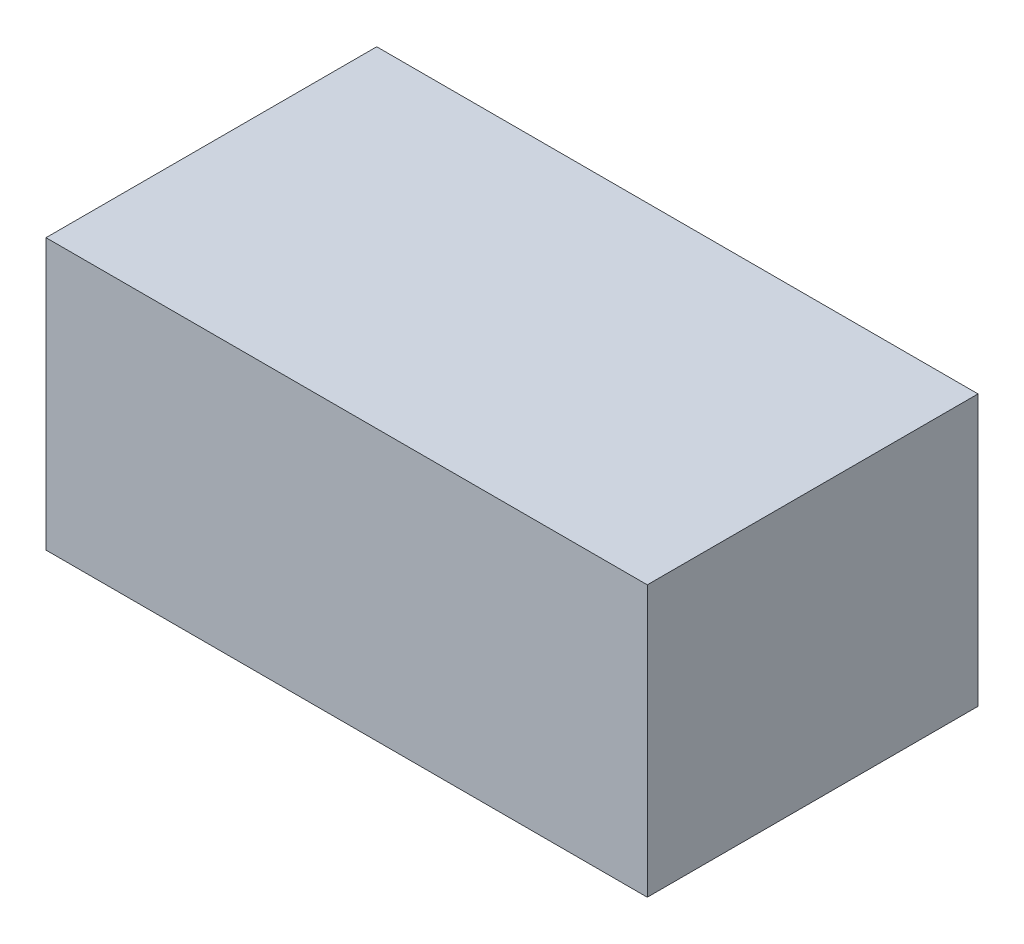
ISO-10303-21;
HEADER;
FILE_DESCRIPTION(('STEP AP214'),'2;1');
FILE_NAME('part.step','',(''),(''),'','','');
FILE_SCHEMA(('AUTOMOTIVE_DESIGN { 1 0 10303 214 1 1 1 1 }'));
ENDSEC;
DATA;
#1=APPLICATION_CONTEXT('core data for automotive mechanical design processes');
#2=APPLICATION_PROTOCOL_DEFINITION('international standard','automotive_design',2000,#1);
#3=PRODUCT_CONTEXT('',#1,'mechanical');
#4=PRODUCT('Part','Part','',(#3));
#5=PRODUCT_RELATED_PRODUCT_CATEGORY('part','',(#4));
#6=PRODUCT_DEFINITION_FORMATION('','',#4);
#7=PRODUCT_DEFINITION_CONTEXT('part definition',#1,'design');
#8=PRODUCT_DEFINITION('design','',#6,#7);
#9=PRODUCT_DEFINITION_SHAPE('','',#8);
#10=(LENGTH_UNIT() NAMED_UNIT(*) SI_UNIT(.MILLI.,.METRE.));
#11=(NAMED_UNIT(*) PLANE_ANGLE_UNIT() SI_UNIT($,.RADIAN.));
#12=(NAMED_UNIT(*) SI_UNIT($,.STERADIAN.) SOLID_ANGLE_UNIT());
#13=UNCERTAINTY_MEASURE_WITH_UNIT(LENGTH_MEASURE(1.E-05),#10,'distance_accuracy_value','');
#14=(GEOMETRIC_REPRESENTATION_CONTEXT(3) GLOBAL_UNCERTAINTY_ASSIGNED_CONTEXT((#13)) GLOBAL_UNIT_ASSIGNED_CONTEXT((#10,
#11,#12)) REPRESENTATION_CONTEXT('',''));
#15=CARTESIAN_POINT('',(0.,0.,0.));
#16=DIRECTION('',(0.,0.,1.));
#17=DIRECTION('',(1.,0.,0.));
#18=AXIS2_PLACEMENT_3D('',#15,#16,#17);
#19=CARTESIAN_POINT('',(0.,0.,55.));
#20=DIRECTION('',(1.,0.,0.));
#21=DIRECTION('',(0.,0.,-1.));
#22=AXIS2_PLACEMENT_3D('',#19,#20,#21);
#23=PLANE('',#22);
#24=DIRECTION('',(0.,-1.,0.));
#25=VECTOR('',#24,1.);
#26=CARTESIAN_POINT('',(0.,0.,0.));
#27=LINE('',#26,#25);
#28=CARTESIAN_POINT('',(0.,45.,0.));
#29=VERTEX_POINT('',#28);
#30=CARTESIAN_POINT('',(0.,0.,0.));
#31=VERTEX_POINT('',#30);
#32=EDGE_CURVE('E97',#29,#31,#27,.T.);
#33=ORIENTED_EDGE('',*,*,#32,.T.);
#34=DIRECTION('',(0.,0.,-1.));
#35=VECTOR('',#34,1.);
#36=CARTESIAN_POINT('',(0.,0.,55.));
#37=LINE('',#36,#35);
#38=CARTESIAN_POINT('',(0.,0.,55.));
#39=VERTEX_POINT('',#38);
#40=EDGE_CURVE('E11',#39,#31,#37,.T.);
#41=ORIENTED_EDGE('',*,*,#40,.F.);
#42=DIRECTION('',(0.,-1.,0.));
#43=VECTOR('',#42,1.);
#44=CARTESIAN_POINT('',(0.,0.,55.));
#45=LINE('',#44,#43);
#46=CARTESIAN_POINT('',(0.,45.,55.));
#47=VERTEX_POINT('',#46);
#48=EDGE_CURVE('E85',#47,#39,#45,.T.);
#49=ORIENTED_EDGE('',*,*,#48,.F.);
#50=DIRECTION('',(0.,0.,-1.));
#51=VECTOR('',#50,1.);
#52=CARTESIAN_POINT('',(0.,45.,55.));
#53=LINE('',#52,#51);
#54=EDGE_CURVE('E93',#47,#29,#53,.T.);
#55=ORIENTED_EDGE('',*,*,#54,.T.);
#56=EDGE_LOOP('',(#33,#41,#49,#55));
#57=FACE_BOUND('',#56,.T.);
#58=ADVANCED_FACE('F34',(#57),#23,.F.);
#59=CARTESIAN_POINT('',(0.,0.,55.));
#60=DIRECTION('',(0.,1.,0.));
#61=DIRECTION('',(0.,0.,1.));
#62=AXIS2_PLACEMENT_3D('',#59,#60,#61);
#63=PLANE('',#62);
#64=DIRECTION('',(1.,0.,0.));
#65=VECTOR('',#64,1.);
#66=CARTESIAN_POINT('',(0.,0.,0.));
#67=LINE('',#66,#65);
#68=CARTESIAN_POINT('',(100.,0.,0.));
#69=VERTEX_POINT('',#68);
#70=EDGE_CURVE('E89',#31,#69,#67,.T.);
#71=ORIENTED_EDGE('',*,*,#70,.T.);
#72=DIRECTION('',(0.,0.,-1.));
#73=VECTOR('',#72,1.);
#74=CARTESIAN_POINT('',(100.,0.,55.));
#75=LINE('',#74,#73);
#76=CARTESIAN_POINT('',(100.,0.,55.));
#77=VERTEX_POINT('',#76);
#78=EDGE_CURVE('E42',#77,#69,#75,.T.);
#79=ORIENTED_EDGE('',*,*,#78,.F.);
#80=DIRECTION('',(1.,0.,0.));
#81=VECTOR('',#80,1.);
#82=CARTESIAN_POINT('',(0.,0.,55.));
#83=LINE('',#82,#81);
#84=EDGE_CURVE('E80',#39,#77,#83,.T.);
#85=ORIENTED_EDGE('',*,*,#84,.F.);
#86=ORIENTED_EDGE('',*,*,#40,.T.);
#87=EDGE_LOOP('',(#71,#79,#85,#86));
#88=FACE_BOUND('',#87,.T.);
#89=ADVANCED_FACE('F88',(#88),#63,.F.);
#90=CARTESIAN_POINT('',(100.,0.,55.));
#91=DIRECTION('',(-1.,0.,0.));
#92=DIRECTION('',(0.,0.,1.));
#93=AXIS2_PLACEMENT_3D('',#90,#91,#92);
#94=PLANE('',#93);
#95=DIRECTION('',(0.,1.,0.));
#96=VECTOR('',#95,1.);
#97=CARTESIAN_POINT('',(100.,0.,0.));
#98=LINE('',#97,#96);
#99=CARTESIAN_POINT('',(100.,45.,0.));
#100=VERTEX_POINT('',#99);
#101=EDGE_CURVE('E67',#69,#100,#98,.T.);
#102=ORIENTED_EDGE('',*,*,#101,.T.);
#103=DIRECTION('',(0.,0.,-1.));
#104=VECTOR('',#103,1.);
#105=CARTESIAN_POINT('',(100.,45.,55.));
#106=LINE('',#105,#104);
#107=CARTESIAN_POINT('',(100.,45.,55.));
#108=VERTEX_POINT('',#107);
#109=EDGE_CURVE('E90',#108,#100,#106,.T.);
#110=ORIENTED_EDGE('',*,*,#109,.F.);
#111=DIRECTION('',(0.,1.,0.));
#112=VECTOR('',#111,1.);
#113=CARTESIAN_POINT('',(100.,0.,55.));
#114=LINE('',#113,#112);
#115=EDGE_CURVE('E83',#77,#108,#114,.T.);
#116=ORIENTED_EDGE('',*,*,#115,.F.);
#117=ORIENTED_EDGE('',*,*,#78,.T.);
#118=EDGE_LOOP('',(#102,#110,#116,#117));
#119=FACE_BOUND('',#118,.T.);
#120=ADVANCED_FACE('F91',(#119),#94,.F.);
#121=CARTESIAN_POINT('',(0.,45.,55.));
#122=DIRECTION('',(0.,-1.,0.));
#123=DIRECTION('',(0.,0.,-1.));
#124=AXIS2_PLACEMENT_3D('',#121,#122,#123);
#125=PLANE('',#124);
#126=DIRECTION('',(-1.,0.,0.));
#127=VECTOR('',#126,1.);
#128=CARTESIAN_POINT('',(0.,45.,0.));
#129=LINE('',#128,#127);
#130=EDGE_CURVE('E73',#100,#29,#129,.T.);
#131=ORIENTED_EDGE('',*,*,#130,.T.);
#132=ORIENTED_EDGE('',*,*,#54,.F.);
#133=DIRECTION('',(-1.,0.,0.));
#134=VECTOR('',#133,1.);
#135=CARTESIAN_POINT('',(0.,45.,55.));
#136=LINE('',#135,#134);
#137=EDGE_CURVE('E50',#108,#47,#136,.T.);
#138=ORIENTED_EDGE('',*,*,#137,.F.);
#139=ORIENTED_EDGE('',*,*,#109,.T.);
#140=EDGE_LOOP('',(#131,#132,#138,#139));
#141=FACE_BOUND('',#140,.T.);
#142=ADVANCED_FACE('F104',(#141),#125,.F.);
#143=CARTESIAN_POINT('',(0.,45.,55.));
#144=DIRECTION('',(0.,0.,-1.));
#145=DIRECTION('',(-1.,0.,0.));
#146=AXIS2_PLACEMENT_3D('',#143,#144,#145);
#147=PLANE('',#146);
#148=ORIENTED_EDGE('',*,*,#48,.T.);
#149=ORIENTED_EDGE('',*,*,#84,.T.);
#150=ORIENTED_EDGE('',*,*,#115,.T.);
#151=ORIENTED_EDGE('',*,*,#137,.T.);
#152=EDGE_LOOP('',(#148,#149,#150,#151));
#153=FACE_BOUND('',#152,.T.);
#154=ADVANCED_FACE('F81',(#153),#147,.F.);
#155=CARTESIAN_POINT('',(0.,45.,0.));
#156=DIRECTION('',(0.,0.,-1.));
#157=DIRECTION('',(-1.,0.,0.));
#158=AXIS2_PLACEMENT_3D('',#155,#156,#157);
#159=PLANE('',#158);
#160=ORIENTED_EDGE('',*,*,#32,.F.);
#161=ORIENTED_EDGE('',*,*,#130,.F.);
#162=ORIENTED_EDGE('',*,*,#101,.F.);
#163=ORIENTED_EDGE('',*,*,#70,.F.);
#164=EDGE_LOOP('',(#160,#161,#162,#163));
#165=FACE_BOUND('',#164,.T.);
#166=ADVANCED_FACE('F107',(#165),#159,.T.);
#167=CLOSED_SHELL('',(#58,#89,#120,#142,#154,#166));
#168=MANIFOLD_SOLID_BREP('B2',#167);
#169=ADVANCED_BREP_SHAPE_REPRESENTATION('',(#18,#168),#14);
#170=SHAPE_DEFINITION_REPRESENTATION(#9,#169);
ENDSEC;
END-ISO-10303-21;
